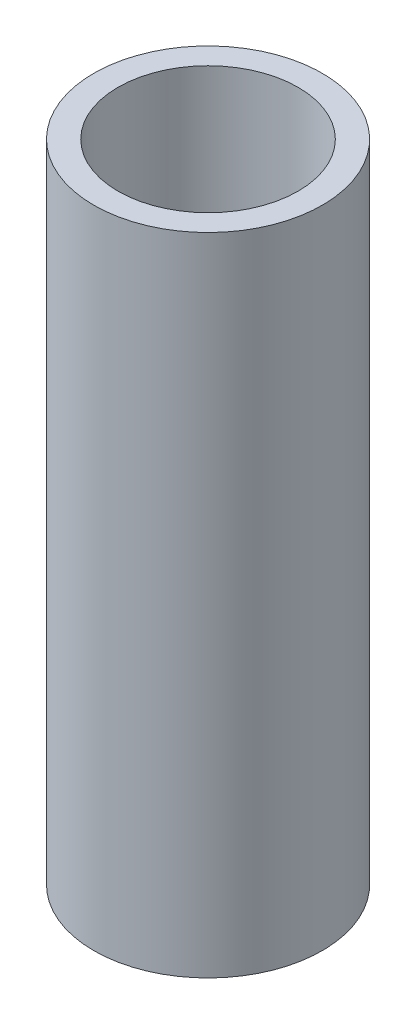
ISO-10303-21;
HEADER;
FILE_DESCRIPTION(('STEP AP214'),'2;1');
FILE_NAME('part.step','',(''),(''),'','','');
FILE_SCHEMA(('AUTOMOTIVE_DESIGN { 1 0 10303 214 1 1 1 1 }'));
ENDSEC;
DATA;
#1=APPLICATION_CONTEXT('core data for automotive mechanical design processes');
#2=APPLICATION_PROTOCOL_DEFINITION('international standard','automotive_design',2000,#1);
#3=PRODUCT_CONTEXT('',#1,'mechanical');
#4=PRODUCT('Part','Part','',(#3));
#5=PRODUCT_RELATED_PRODUCT_CATEGORY('part','',(#4));
#6=PRODUCT_DEFINITION_FORMATION('','',#4);
#7=PRODUCT_DEFINITION_CONTEXT('part definition',#1,'design');
#8=PRODUCT_DEFINITION('design','',#6,#7);
#9=PRODUCT_DEFINITION_SHAPE('','',#8);
#10=(LENGTH_UNIT() NAMED_UNIT(*) SI_UNIT(.MILLI.,.METRE.));
#11=(NAMED_UNIT(*) PLANE_ANGLE_UNIT() SI_UNIT($,.RADIAN.));
#12=(NAMED_UNIT(*) SI_UNIT($,.STERADIAN.) SOLID_ANGLE_UNIT());
#13=UNCERTAINTY_MEASURE_WITH_UNIT(LENGTH_MEASURE(1.E-05),#10,'distance_accuracy_value','');
#14=(GEOMETRIC_REPRESENTATION_CONTEXT(3) GLOBAL_UNCERTAINTY_ASSIGNED_CONTEXT((#13)) GLOBAL_UNIT_ASSIGNED_CONTEXT((#10,
#11,#12)) REPRESENTATION_CONTEXT('',''));
#15=CARTESIAN_POINT('',(0.,0.,0.));
#16=DIRECTION('',(0.,0.,1.));
#17=DIRECTION('',(1.,0.,0.));
#18=AXIS2_PLACEMENT_3D('',#15,#16,#17);
#19=CARTESIAN_POINT('',(0.,98.8739407231615,0.));
#20=DIRECTION('',(0.,-1.,0.));
#21=DIRECTION('',(0.,0.,-1.));
#22=AXIS2_PLACEMENT_3D('',#19,#20,#21);
#23=CYLINDRICAL_SURFACE('',#22,17.5);
#24=CARTESIAN_POINT('',(0.,98.8739407231615,0.));
#25=DIRECTION('',(0.,1.,0.));
#26=DIRECTION('',(0.,0.,1.));
#27=AXIS2_PLACEMENT_3D('',#24,#25,#26);
#28=CIRCLE('',#27,17.5);
#29=CARTESIAN_POINT('',(0.,98.8739407231615,17.5));
#30=VERTEX_POINT('',#29);
#31=EDGE_CURVE('E10',#30,#30,#28,.T.);
#32=ORIENTED_EDGE('',*,*,#31,.F.);
#33=EDGE_LOOP('',(#32));
#34=FACE_BOUND('',#33,.T.);
#35=CARTESIAN_POINT('',(0.,0.,0.));
#36=DIRECTION('',(0.,1.,0.));
#37=DIRECTION('',(0.,0.,1.));
#38=AXIS2_PLACEMENT_3D('',#35,#36,#37);
#39=CIRCLE('',#38,17.5);
#40=CARTESIAN_POINT('',(0.,0.,17.5));
#41=VERTEX_POINT('',#40);
#42=EDGE_CURVE('E37',#41,#41,#39,.T.);
#43=ORIENTED_EDGE('',*,*,#42,.T.);
#44=EDGE_LOOP('',(#43));
#45=FACE_BOUND('',#44,.T.);
#46=ADVANCED_FACE('F40',(#34,#45),#23,.T.);
#47=CARTESIAN_POINT('',(0.,98.8739407231615,0.));
#48=DIRECTION('',(0.,1.,0.));
#49=DIRECTION('',(0.,0.,1.));
#50=AXIS2_PLACEMENT_3D('',#47,#48,#49);
#51=PLANE('',#50);
#52=CARTESIAN_POINT('',(0.,98.8739407231615,0.));
#53=DIRECTION('',(0.,1.,0.));
#54=DIRECTION('',(0.,0.,1.));
#55=AXIS2_PLACEMENT_3D('',#52,#53,#54);
#56=CIRCLE('',#55,13.78882928056);
#57=CARTESIAN_POINT('',(0.,98.8739407231615,13.78882928056));
#58=VERTEX_POINT('',#57);
#59=EDGE_CURVE('E50',#58,#58,#56,.T.);
#60=ORIENTED_EDGE('',*,*,#59,.F.);
#61=EDGE_LOOP('',(#60));
#62=FACE_BOUND('',#61,.T.);
#63=ORIENTED_EDGE('',*,*,#31,.T.);
#64=EDGE_LOOP('',(#63));
#65=FACE_BOUND('',#64,.T.);
#66=ADVANCED_FACE('F59',(#62,#65),#51,.T.);
#67=CARTESIAN_POINT('',(0.,0.,0.));
#68=DIRECTION('',(0.,1.,0.));
#69=DIRECTION('',(0.,0.,1.));
#70=AXIS2_PLACEMENT_3D('',#67,#68,#69);
#71=PLANE('',#70);
#72=CARTESIAN_POINT('',(0.,0.,0.));
#73=DIRECTION('',(0.,1.,0.));
#74=DIRECTION('',(0.,0.,1.));
#75=AXIS2_PLACEMENT_3D('',#72,#73,#74);
#76=CIRCLE('',#75,13.78882928056);
#77=CARTESIAN_POINT('',(0.,0.,13.78882928056));
#78=VERTEX_POINT('',#77);
#79=EDGE_CURVE('E47',#78,#78,#76,.T.);
#80=ORIENTED_EDGE('',*,*,#79,.T.);
#81=EDGE_LOOP('',(#80));
#82=FACE_BOUND('',#81,.T.);
#83=ORIENTED_EDGE('',*,*,#42,.F.);
#84=EDGE_LOOP('',(#83));
#85=FACE_BOUND('',#84,.T.);
#86=ADVANCED_FACE('F58',(#82,#85),#71,.F.);
#87=CARTESIAN_POINT('',(0.,98.8739407231615,0.));
#88=DIRECTION('',(0.,-1.,0.));
#89=DIRECTION('',(0.,0.,-1.));
#90=AXIS2_PLACEMENT_3D('',#87,#88,#89);
#91=CYLINDRICAL_SURFACE('',#90,13.78882928056);
#92=ORIENTED_EDGE('',*,*,#59,.T.);
#93=EDGE_LOOP('',(#92));
#94=FACE_BOUND('',#93,.T.);
#95=ORIENTED_EDGE('',*,*,#79,.F.);
#96=EDGE_LOOP('',(#95));
#97=FACE_BOUND('',#96,.T.);
#98=ADVANCED_FACE('F54',(#94,#97),#91,.F.);
#99=CLOSED_SHELL('',(#46,#66,#86,#98));
#100=MANIFOLD_SOLID_BREP('B2',#99);
#101=ADVANCED_BREP_SHAPE_REPRESENTATION('',(#18,#100),#14);
#102=SHAPE_DEFINITION_REPRESENTATION(#9,#101);
ENDSEC;
END-ISO-10303-21;
